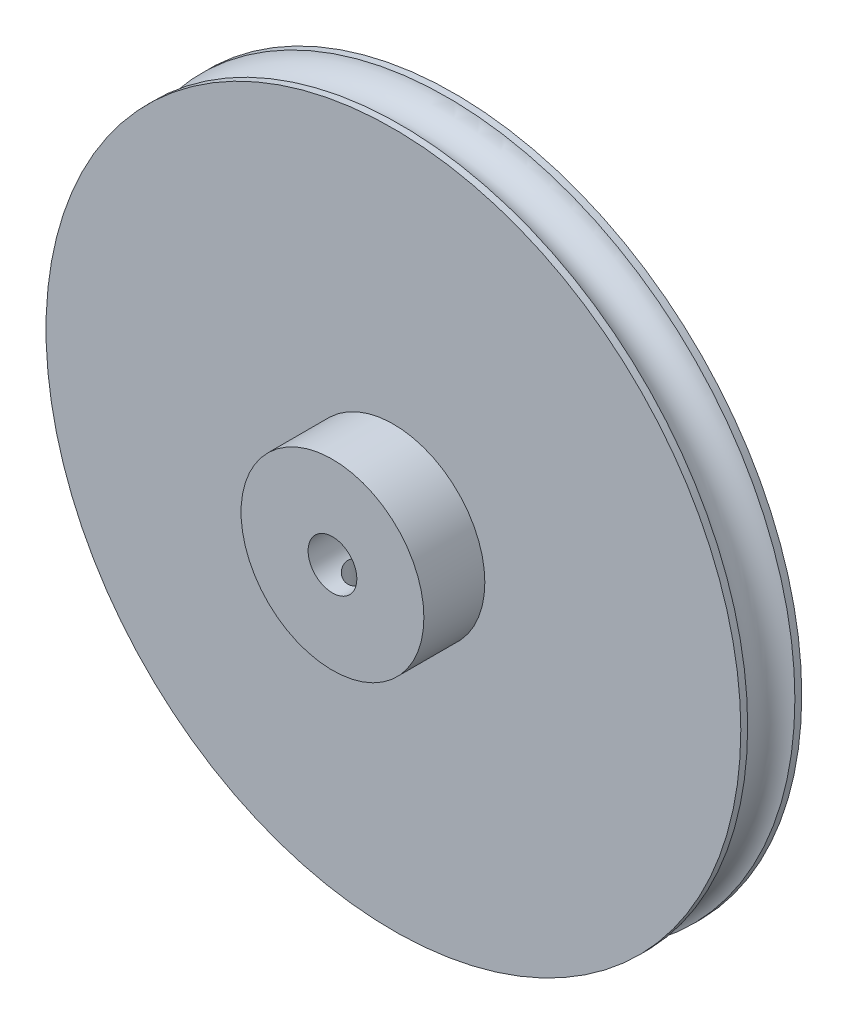
ISO-10303-21;
HEADER;
FILE_DESCRIPTION(('STEP AP214'),'2;1');
FILE_NAME('part.step','',(''),(''),'','','');
FILE_SCHEMA(('AUTOMOTIVE_DESIGN { 1 0 10303 214 1 1 1 1 }'));
ENDSEC;
DATA;
#1=APPLICATION_CONTEXT('core data for automotive mechanical design processes');
#2=APPLICATION_PROTOCOL_DEFINITION('international standard','automotive_design',2000,#1);
#3=PRODUCT_CONTEXT('',#1,'mechanical');
#4=PRODUCT('Part','Part','',(#3));
#5=PRODUCT_RELATED_PRODUCT_CATEGORY('part','',(#4));
#6=PRODUCT_DEFINITION_FORMATION('','',#4);
#7=PRODUCT_DEFINITION_CONTEXT('part definition',#1,'design');
#8=PRODUCT_DEFINITION('design','',#6,#7);
#9=PRODUCT_DEFINITION_SHAPE('','',#8);
#10=(LENGTH_UNIT() NAMED_UNIT(*) SI_UNIT(.MILLI.,.METRE.));
#11=(NAMED_UNIT(*) PLANE_ANGLE_UNIT() SI_UNIT($,.RADIAN.));
#12=(NAMED_UNIT(*) SI_UNIT($,.STERADIAN.) SOLID_ANGLE_UNIT());
#13=UNCERTAINTY_MEASURE_WITH_UNIT(LENGTH_MEASURE(1.E-05),#10,'distance_accuracy_value','');
#14=(GEOMETRIC_REPRESENTATION_CONTEXT(3) GLOBAL_UNCERTAINTY_ASSIGNED_CONTEXT((#13)) GLOBAL_UNIT_ASSIGNED_CONTEXT((#10,
#11,#12)) REPRESENTATION_CONTEXT('',''));
#15=CARTESIAN_POINT('',(0.,0.,0.));
#16=DIRECTION('',(0.,0.,1.));
#17=DIRECTION('',(1.,0.,0.));
#18=AXIS2_PLACEMENT_3D('',#15,#16,#17);
#19=CARTESIAN_POINT('',(0.,0.,-5.));
#20=DIRECTION('',(0.,0.,1.));
#21=DIRECTION('',(1.,0.,0.));
#22=AXIS2_PLACEMENT_3D('',#19,#20,#21);
#23=CYLINDRICAL_SURFACE('',#22,28.5);
#24=CARTESIAN_POINT('',(0.,0.,0.));
#25=DIRECTION('',(0.,0.,1.));
#26=DIRECTION('',(1.,0.,0.));
#27=AXIS2_PLACEMENT_3D('',#24,#25,#26);
#28=CIRCLE('',#27,28.5);
#29=CARTESIAN_POINT('',(28.5,0.,0.));
#30=VERTEX_POINT('',#29);
#31=EDGE_CURVE('E43',#30,#30,#28,.T.);
#32=ORIENTED_EDGE('',*,*,#31,.F.);
#33=EDGE_LOOP('',(#32));
#34=FACE_BOUND('',#33,.T.);
#35=CARTESIAN_POINT('',(0.,0.,-0.563508326896291));
#36=DIRECTION('',(0.,0.,-1.));
#37=DIRECTION('',(-1.,0.,0.));
#38=AXIS2_PLACEMENT_3D('',#35,#36,#37);
#39=CIRCLE('',#38,28.5);
#40=CARTESIAN_POINT('',(-28.5,0.,-0.563508326896291));
#41=VERTEX_POINT('',#40);
#42=EDGE_CURVE('E56',#41,#41,#39,.F.);
#43=ORIENTED_EDGE('',*,*,#42,.T.);
#44=EDGE_LOOP('',(#43));
#45=FACE_BOUND('',#44,.T.);
#46=ADVANCED_FACE('F32',(#34,#45),#23,.T.);
#47=CARTESIAN_POINT('',(0.,0.,-5.));
#48=DIRECTION('',(0.,0.,1.));
#49=DIRECTION('',(1.,0.,0.));
#50=AXIS2_PLACEMENT_3D('',#47,#48,#49);
#51=CIRCLE('',#50,28.5);
#52=CARTESIAN_POINT('',(28.5,0.,-5.));
#53=VERTEX_POINT('',#52);
#54=EDGE_CURVE('E10',#53,#53,#51,.T.);
#55=ORIENTED_EDGE('',*,*,#54,.T.);
#56=EDGE_LOOP('',(#55));
#57=FACE_BOUND('',#56,.T.);
#58=CARTESIAN_POINT('',(0.,0.,-4.43649167310371));
#59=DIRECTION('',(0.,0.,1.));
#60=DIRECTION('',(1.,0.,0.));
#61=AXIS2_PLACEMENT_3D('',#58,#59,#60);
#62=CIRCLE('',#61,28.5);
#63=CARTESIAN_POINT('',(28.5,0.,-4.43649167310371));
#64=VERTEX_POINT('',#63);
#65=EDGE_CURVE('E54',#64,#64,#62,.F.);
#66=ORIENTED_EDGE('',*,*,#65,.T.);
#67=EDGE_LOOP('',(#66));
#68=FACE_BOUND('',#67,.T.);
#69=ADVANCED_FACE('F84',(#57,#68),#23,.T.);
#70=CARTESIAN_POINT('',(0.,0.,0.));
#71=DIRECTION('',(0.,0.,1.));
#72=DIRECTION('',(1.,0.,0.));
#73=AXIS2_PLACEMENT_3D('',#70,#71,#72);
#74=PLANE('',#73);
#75=ORIENTED_EDGE('',*,*,#31,.T.);
#76=EDGE_LOOP('',(#75));
#77=FACE_BOUND('',#76,.T.);
#78=CARTESIAN_POINT('',(0.,0.,0.));
#79=DIRECTION('',(0.,0.,1.));
#80=DIRECTION('',(1.,0.,0.));
#81=AXIS2_PLACEMENT_3D('',#78,#79,#80);
#82=CIRCLE('',#81,7.5);
#83=CARTESIAN_POINT('',(7.5,0.,0.));
#84=VERTEX_POINT('',#83);
#85=EDGE_CURVE('E51',#84,#84,#82,.T.);
#86=ORIENTED_EDGE('',*,*,#85,.F.);
#87=EDGE_LOOP('',(#86));
#88=FACE_BOUND('',#87,.T.);
#89=ADVANCED_FACE('F81',(#77,#88),#74,.T.);
#90=CARTESIAN_POINT('',(0.,0.,-5.));
#91=DIRECTION('',(0.,0.,1.));
#92=DIRECTION('',(1.,0.,0.));
#93=AXIS2_PLACEMENT_3D('',#90,#91,#92);
#94=PLANE('',#93);
#95=CARTESIAN_POINT('',(0.,0.,-5.));
#96=DIRECTION('',(0.,0.,1.));
#97=DIRECTION('',(1.,0.,0.));
#98=AXIS2_PLACEMENT_3D('',#95,#96,#97);
#99=CIRCLE('',#98,2.);
#100=CARTESIAN_POINT('',(2.,0.,-5.));
#101=VERTEX_POINT('',#100);
#102=EDGE_CURVE('E63',#101,#101,#99,.F.);
#103=ORIENTED_EDGE('',*,*,#102,.F.);
#104=EDGE_LOOP('',(#103));
#105=FACE_BOUND('',#104,.T.);
#106=ORIENTED_EDGE('',*,*,#54,.F.);
#107=EDGE_LOOP('',(#106));
#108=FACE_BOUND('',#107,.T.);
#109=ADVANCED_FACE('F83',(#105,#108),#94,.F.);
#110=CARTESIAN_POINT('',(0.,0.,5.));
#111=DIRECTION('',(0.,0.,-1.));
#112=DIRECTION('',(-1.,0.,0.));
#113=AXIS2_PLACEMENT_3D('',#110,#111,#112);
#114=CYLINDRICAL_SURFACE('',#113,7.5);
#115=CARTESIAN_POINT('',(0.,-7.5,3.74999999999999));
#116=CARTESIAN_POINT('',(0.0696954524791068,-7.49999880584412,3.74999720552608));
#117=CARTESIAN_POINT('',(0.139428940919409,-7.49901838956517,3.74415136251553));
#118=CARTESIAN_POINT('',(0.276940110836519,-7.49520172470694,3.72093217061733));
#119=CARTESIAN_POINT('',(0.344715933979621,-7.49236376961945,3.70354822154419));
#120=CARTESIAN_POINT('',(0.476302373606318,-7.48515034118225,3.65779227570361));
#121=CARTESIAN_POINT('',(0.540116184215946,-7.48077612579597,3.6294292671797));
#122=CARTESIAN_POINT('',(0.662070920988967,-7.47097113541035,3.56254385397379));
#123=CARTESIAN_POINT('',(0.72021249493929,-7.46554048127217,3.52402261125849));
#124=CARTESIAN_POINT('',(0.829736307145833,-7.45416658729157,3.43752245808976));
#125=CARTESIAN_POINT('',(0.881056451767477,-7.44821935907428,3.38946544268193));
#126=CARTESIAN_POINT('',(0.974944249329956,-7.43651313438366,3.28542601576359));
#127=CARTESIAN_POINT('',(1.01751134969548,-7.43075414981334,3.22944310427169));
#128=CARTESIAN_POINT('',(1.09293356280256,-7.4200378287989,3.11071451690147));
#129=CARTESIAN_POINT('',(1.12572727643049,-7.41508564545818,3.04792933159762));
#130=CARTESIAN_POINT('',(1.1802791827056,-7.40659894897338,2.91764521784968));
#131=CARTESIAN_POINT('',(1.2020381207828,-7.40306434007154,2.85014660816118));
#132=CARTESIAN_POINT('',(1.23370718889239,-7.39785268421378,2.71300986257173));
#133=CARTESIAN_POINT('',(1.24372451456769,-7.3961588424285,2.6433971317493));
#134=CARTESIAN_POINT('',(1.25195836264493,-7.39476969468325,2.50345986155826));
#135=CARTESIAN_POINT('',(1.25017572019449,-7.39507424728607,2.43313537291635));
#136=CARTESIAN_POINT('',(1.23494754919807,-7.39763214431778,2.29453606936228));
#137=CARTESIAN_POINT('',(1.22162244094488,-7.39986536659459,2.22624759822739));
#138=CARTESIAN_POINT('',(1.18387657020171,-7.40599747605504,2.09288934108544));
#139=CARTESIAN_POINT('',(1.15945542715986,-7.40989642036636,2.02781966555573));
#140=CARTESIAN_POINT('',(1.10008862304695,-7.4189423966705,1.90238558827955));
#141=CARTESIAN_POINT('',(1.06509295693985,-7.42409533553663,1.84204529695939));
#142=CARTESIAN_POINT('',(0.985606008778709,-7.43506459207505,1.72804779973081));
#143=CARTESIAN_POINT('',(0.941113960327136,-7.44088096327143,1.67439113377254));
#144=CARTESIAN_POINT('',(0.84324110607952,-7.45261013939893,1.57458695709633));
#145=CARTESIAN_POINT('',(0.789756981936557,-7.45852324615826,1.52854074072997));
#146=CARTESIAN_POINT('',(0.675767624490818,-7.46971300698362,1.44606111866734));
#147=CARTESIAN_POINT('',(0.615262345953206,-7.47498965694873,1.40962777490839));
#148=CARTESIAN_POINT('',(0.488852958083351,-7.48431946446456,1.34739888643187));
#149=CARTESIAN_POINT('',(0.422944362782327,-7.48837159203724,1.32161229033438));
#150=CARTESIAN_POINT('',(0.287649172801363,-7.4947875150633,1.28150289237702));
#151=CARTESIAN_POINT('',(0.218262869589732,-7.49715145175237,1.26717913151315));
#152=CARTESIAN_POINT('',(0.078854950650811,-7.49990564921343,1.25053932076944));
#153=CARTESIAN_POINT('',(0.00885036857550532,-7.50031876506392,1.24808421409721));
#154=CARTESIAN_POINT('',(-0.130569886444943,-7.49918737210585,1.25488067221407));
#155=CARTESIAN_POINT('',(-0.199985581946018,-7.49764293862059,1.26413178656688));
#156=CARTESIAN_POINT('',(-0.335828087773379,-7.49278413469101,1.29396242466775));
#157=CARTESIAN_POINT('',(-0.402270434192687,-7.48948052400655,1.31447310419507));
#158=CARTESIAN_POINT('',(-0.530773442430217,-7.48147232227679,1.36616725909978));
#159=CARTESIAN_POINT('',(-0.592833857954855,-7.4767676525601,1.39735133381765));
#160=CARTESIAN_POINT('',(-0.711415344734474,-7.46642258151204,1.4698255623484));
#161=CARTESIAN_POINT('',(-0.767882625468568,-7.46077427943511,1.51120257808363));
#162=CARTESIAN_POINT('',(-0.873121792751337,-7.4491923369595,1.60276865769254));
#163=CARTESIAN_POINT('',(-0.921893119848284,-7.44325867585773,1.65295836163834));
#164=CARTESIAN_POINT('',(-1.01087138982899,-7.43170087617923,1.76134877403572));
#165=CARTESIAN_POINT('',(-1.05098438055685,-7.42608058068553,1.81962708275721));
#166=CARTESIAN_POINT('',(-1.12085115514748,-7.41585764888942,1.94217648456927));
#167=CARTESIAN_POINT('',(-1.1506052673849,-7.4112549803301,2.00644738761375));
#168=CARTESIAN_POINT('',(-1.19876916573657,-7.40361726848852,2.13889486640607));
#169=CARTESIAN_POINT('',(-1.21722571627396,-7.40057577155532,2.20705404751525));
#170=CARTESIAN_POINT('',(-1.24241772688913,-7.39638858417631,2.34556006461088));
#171=CARTESIAN_POINT('',(-1.24915420597307,-7.39524272891361,2.41590670986603));
#172=CARTESIAN_POINT('',(-1.25068643302367,-7.39498366542006,2.5558525829812));
#173=CARTESIAN_POINT('',(-1.24563006806258,-7.39584528252825,2.62545018928764));
#174=CARTESIAN_POINT('',(-1.22403991947841,-7.39944890726864,2.76278962402538));
#175=CARTESIAN_POINT('',(-1.20750617305623,-7.40219090880607,2.83053145847093));
#176=CARTESIAN_POINT('',(-1.16348724479744,-7.40923678140859,2.9621792186463));
#177=CARTESIAN_POINT('',(-1.13601479530021,-7.41353883609835,3.02608950502801));
#178=CARTESIAN_POINT('',(-1.07091350195795,-7.42322184461104,3.14841783459742));
#179=CARTESIAN_POINT('',(-1.03328415437427,-7.428602851942,3.20683560518606));
#180=CARTESIAN_POINT('',(-0.94840944218607,-7.43991727022811,3.31726779155387));
#181=CARTESIAN_POINT('',(-0.901055281796816,-7.44585647788151,3.36919800835013));
#182=CARTESIAN_POINT('',(-0.798304515690108,-7.45757186180421,3.46442580223746));
#183=CARTESIAN_POINT('',(-0.742906056456312,-7.46334800013273,3.50772138431908));
#184=CARTESIAN_POINT('',(-0.625184584820136,-7.4741326482111,3.58472413409996));
#185=CARTESIAN_POINT('',(-0.562816393766405,-7.47913558126552,3.61836301965647));
#186=CARTESIAN_POINT('',(-0.433256534689487,-7.48775583800888,3.67463474230495));
#187=CARTESIAN_POINT('',(-0.366069747415002,-7.49137454088741,3.69727854053984));
#188=CARTESIAN_POINT('',(-0.248851655022698,-7.49602895416478,3.72600263706332));
#189=CARTESIAN_POINT('',(-0.199529415149222,-7.49751013636679,3.73498723480797));
#190=CARTESIAN_POINT('',(-0.100144655159903,-7.4994960799306,3.74698686892237));
#191=CARTESIAN_POINT('',(-0.0500821478042465,-7.50000085810321,3.75000200806867));
#192=CARTESIAN_POINT('',(0.,-7.5,3.74999999999999));
#193=B_SPLINE_CURVE_WITH_KNOTS('',3,(#115,#116,#117,#118,#119,#120,#121,#122,#123,#124,#125,
#126,#127,#128,#129,#130,#131,#132,#133,#134,#135,#136,#137,#138,#139,#140,#141,#142,#143,#144,
#145,#146,#147,#148,#149,#150,#151,#152,#153,#154,#155,#156,#157,#158,#159,#160,#161,#162,#163,
#164,#165,#166,#167,#168,#169,#170,#171,#172,#173,#174,#175,#176,#177,#178,#179,#180,#181,#182,
#183,#184,#185,#186,#187,#188,#189,#190,#191,#192),.UNSPECIFIED.,.T.,.F.,(4,2,2,2,2,2,2,2,2,2,2,
2,2,2,2,2,2,2,2,2,2,2,2,2,2,2,2,2,2,2,2,2,2,2,2,2,2,2,4),(0.,0.208903292469253,
0.417998772847707,0.62692343351263,0.835824206337388,1.04651245531165,1.25721400084927,
1.46921260411919,1.68119688438089,1.8912303855171,2.10124902160442,2.30910260880203,
2.51696332512689,2.72582278316277,2.93469910340284,3.14616384955661,3.35762995817921,
3.56927344457949,3.78089922260571,3.99003941745695,4.19917156517926,4.40703903503204,
4.61491817913029,4.82463412813508,5.03436531527137,5.24626911003805,5.45816618687967,
5.66918011170882,5.88017568893304,6.08853954761345,6.29690273094061,6.50502409113106,
6.71315577514663,6.9237569209669,7.1344066693948,7.34651115803594,7.5584037606503,
7.70852124082003,7.85863613638478),.UNSPECIFIED.);
#194=CARTESIAN_POINT('',(0.,-7.5,3.74999999999999));
#195=VERTEX_POINT('',#194);
#196=EDGE_CURVE('E57',#195,#195,#193,.T.);
#197=ORIENTED_EDGE('',*,*,#196,.T.);
#198=EDGE_LOOP('',(#197));
#199=FACE_BOUND('',#198,.T.);
#200=CARTESIAN_POINT('',(0.,0.,5.));
#201=DIRECTION('',(0.,0.,1.));
#202=DIRECTION('',(1.,0.,0.));
#203=AXIS2_PLACEMENT_3D('',#200,#201,#202);
#204=CIRCLE('',#203,7.5);
#205=CARTESIAN_POINT('',(7.5,0.,5.));
#206=VERTEX_POINT('',#205);
#207=EDGE_CURVE('E48',#206,#206,#204,.T.);
#208=ORIENTED_EDGE('',*,*,#207,.F.);
#209=EDGE_LOOP('',(#208));
#210=FACE_BOUND('',#209,.T.);
#211=ORIENTED_EDGE('',*,*,#85,.T.);
#212=EDGE_LOOP('',(#211));
#213=FACE_BOUND('',#212,.T.);
#214=ADVANCED_FACE('F79',(#199,#210,#213),#114,.T.);
#215=CARTESIAN_POINT('',(0.,0.,5.));
#216=DIRECTION('',(0.,0.,1.));
#217=DIRECTION('',(1.,0.,0.));
#218=AXIS2_PLACEMENT_3D('',#215,#216,#217);
#219=PLANE('',#218);
#220=CARTESIAN_POINT('',(0.,0.,5.));
#221=DIRECTION('',(0.,0.,1.));
#222=DIRECTION('',(1.,0.,0.));
#223=AXIS2_PLACEMENT_3D('',#220,#221,#222);
#224=CIRCLE('',#223,2.);
#225=CARTESIAN_POINT('',(2.,0.,5.));
#226=VERTEX_POINT('',#225);
#227=EDGE_CURVE('E59',#226,#226,#224,.T.);
#228=ORIENTED_EDGE('',*,*,#227,.F.);
#229=EDGE_LOOP('',(#228));
#230=FACE_BOUND('',#229,.T.);
#231=ORIENTED_EDGE('',*,*,#207,.T.);
#232=EDGE_LOOP('',(#231));
#233=FACE_BOUND('',#232,.T.);
#234=ADVANCED_FACE('F128',(#230,#233),#219,.T.);
#235=CARTESIAN_POINT('',(0.,0.,-5.001));
#236=DIRECTION('',(0.,0.,1.));
#237=DIRECTION('',(1.,0.,0.));
#238=AXIS2_PLACEMENT_3D('',#235,#236,#237);
#239=CYLINDRICAL_SURFACE('',#238,2.);
#240=CARTESIAN_POINT('',(0.,-2.,3.74999999999999));
#241=CARTESIAN_POINT('',(-0.0635104730002022,-1.99999595305313,3.74999565000121));
#242=CARTESIAN_POINT('',(-0.127096441053757,-1.99694323311001,3.74512698818218));
#243=CARTESIAN_POINT('',(-0.25231826226528,-1.98502167724102,3.72591419657049));
#244=CARTESIAN_POINT('',(-0.313950163299071,-1.97614175574896,3.71155200607451));
#245=CARTESIAN_POINT('',(-0.43320555813678,-1.95345852982134,3.67418863683794));
#246=CARTESIAN_POINT('',(-0.490847243665013,-1.93967960778663,3.65123021215911));
#247=CARTESIAN_POINT('',(-0.601260368868356,-1.90834598486073,3.59761414920324));
#248=CARTESIAN_POINT('',(-0.654032347276148,-1.89079170235271,3.5669573639908));
#249=CARTESIAN_POINT('',(-0.757974192167968,-1.85170152902273,3.49611342681502));
#250=CARTESIAN_POINT('',(-0.808679560769972,-1.82995962224617,3.45536070002454));
#251=CARTESIAN_POINT('',(-0.902986375146753,-1.78531349913632,3.36678082549344));
#252=CARTESIAN_POINT('',(-0.946578107215727,-1.76240774858553,3.31894417174205));
#253=CARTESIAN_POINT('',(-1.03142873237132,-1.71430418655199,3.20996610579548));
#254=CARTESIAN_POINT('',(-1.0715720602915,-1.68921610993413,3.14790021339272));
#255=CARTESIAN_POINT('',(-1.14073966020038,-1.64330198128732,3.01643518455281));
#256=CARTESIAN_POINT('',(-1.16978270899533,-1.62246875996239,2.94704868742392));
#257=CARTESIAN_POINT('',(-1.2093340058598,-1.59309575627365,2.82118947622128));
#258=CARTESIAN_POINT('',(-1.22269552371393,-1.58276905990074,2.76603318146118));
#259=CARTESIAN_POINT('',(-1.24181843585479,-1.56781357325806,2.6536940743892));
#260=CARTESIAN_POINT('',(-1.24759056342087,-1.56317673673693,2.59651424172551));
#261=CARTESIAN_POINT('',(-1.25118918245719,-1.56029885782828,2.48158698324888));
#262=CARTESIAN_POINT('',(-1.2489948372785,-1.56207458771719,2.4238384635376));
#263=CARTESIAN_POINT('',(-1.23676317046803,-1.57177402383921,2.30968989681104));
#264=CARTESIAN_POINT('',(-1.22671956265042,-1.57970265767111,2.25329096796092));
#265=CARTESIAN_POINT('',(-1.19968103371473,-1.60032573121781,2.14456154734252));
#266=CARTESIAN_POINT('',(-1.18285016736896,-1.61290715104815,2.09216754431573));
#267=CARTESIAN_POINT('',(-1.14290189820936,-1.64145566443407,1.99083881759458));
#268=CARTESIAN_POINT('',(-1.11978227193695,-1.65742395501354,1.9419053251255));
#269=CARTESIAN_POINT('',(-1.06294892954948,-1.6945481599302,1.83916672616726));
#270=CARTESIAN_POINT('',(-1.02806296601169,-1.7161159157596,1.78615918987961));
#271=CARTESIAN_POINT('',(-0.950881463002089,-1.76005711791244,1.68616972099952));
#272=CARTESIAN_POINT('',(-0.908578308011424,-1.78243137335976,1.63919406829348));
#273=CARTESIAN_POINT('',(-0.809519713023318,-1.82979894916857,1.54469825062961));
#274=CARTESIAN_POINT('',(-0.75153135359532,-1.85461531676594,1.49836702574117));
#275=CARTESIAN_POINT('',(-0.627148099593557,-1.90028055062445,1.41614910411276));
#276=CARTESIAN_POINT('',(-0.560756523881986,-1.92113097514764,1.38025830227108));
#277=CARTESIAN_POINT('',(-0.424883562934736,-1.95553372961317,1.32223631161858));
#278=CARTESIAN_POINT('',(-0.355763457732359,-1.96941976591574,1.29946596001882));
#279=CARTESIAN_POINT('',(-0.213612154574966,-1.98984929310048,1.2662350720172));
#280=CARTESIAN_POINT('',(-0.140586648341295,-1.9964031799007,1.25575710577801));
#281=CARTESIAN_POINT('',(-0.00451561874058041,-2.00097840540091,1.24843414993881));
#282=CARTESIAN_POINT('',(0.0584027741637924,-2.00012161345511,1.24979682204616));
#283=CARTESIAN_POINT('',(0.182972117996316,-1.99258901494327,1.26188282842074));
#284=CARTESIAN_POINT('',(0.244623154962739,-1.98591360473591,1.27260552509218));
#285=CARTESIAN_POINT('',(0.362521070658194,-1.9677405228307,1.30223853669197));
#286=CARTESIAN_POINT('',(0.418885009953208,-1.95644170526844,1.32081215679666));
#287=CARTESIAN_POINT('',(0.527638281070991,-1.92995684104751,1.36529638927858));
#288=CARTESIAN_POINT('',(0.580026945470718,-1.91477014350266,1.39120823025517));
#289=CARTESIAN_POINT('',(0.685084056277259,-1.87990012356,1.45251520599549));
#290=CARTESIAN_POINT('',(0.737246967843406,-1.85991764817224,1.48860356923825));
#291=CARTESIAN_POINT('',(0.835142640217341,-1.81806970001717,1.56779386515282));
#292=CARTESIAN_POINT('',(0.880868151291854,-1.79620214826384,1.61090358925455));
#293=CARTESIAN_POINT('',(0.971474198022882,-1.74905869713091,1.71013503941267));
#294=CARTESIAN_POINT('',(1.01526851939752,-1.72374883414957,1.7672372062948));
#295=CARTESIAN_POINT('',(1.09280351885684,-1.67566762748172,1.88887578494427));
#296=CARTESIAN_POINT('',(1.12655115718693,-1.65289453322337,1.95340700675301));
#297=CARTESIAN_POINT('',(1.17684772011827,-1.61733530314592,2.07469214805689));
#298=CARTESIAN_POINT('',(1.19551895865479,-1.6034563619378,2.13024075073223));
#299=CARTESIAN_POINT('',(1.22500108205244,-1.58105030663768,2.24439314576893));
#300=CARTESIAN_POINT('',(1.23582424983126,-1.57251483242606,2.30299200945147));
#301=CARTESIAN_POINT('',(1.24901383653653,-1.56206324988732,2.4220902768807));
#302=CARTESIAN_POINT('',(1.25133186963291,-1.5601850167457,2.48259858548818));
#303=CARTESIAN_POINT('',(1.24719778716816,-1.56349063109848,2.60313096036605));
#304=CARTESIAN_POINT('',(1.24074275650141,-1.56867682595587,2.66315485900952));
#305=CARTESIAN_POINT('',(1.22038272403398,-1.58455388771335,2.77602979505137));
#306=CARTESIAN_POINT('',(1.20711919499769,-1.59476808051061,2.82906930141642));
#307=CARTESIAN_POINT('',(1.17417623469512,-1.61917530435691,2.93213505958591));
#308=CARTESIAN_POINT('',(1.15449412799405,-1.63336999423728,2.98216004453751));
#309=CARTESIAN_POINT('',(1.10602690439617,-1.66663902886519,3.0855967438727));
#310=CARTESIAN_POINT('',(1.07633644455459,-1.68612230498998,3.13845029847656));
#311=CARTESIAN_POINT('',(1.01000017036388,-1.72667706411869,3.23893836724601));
#312=CARTESIAN_POINT('',(0.973348732866927,-1.74774982276826,3.28656861256048));
#313=CARTESIAN_POINT('',(0.885670221416046,-1.79401910731182,3.38501425497784));
#314=CARTESIAN_POINT('',(0.83323367424678,-1.81920541808777,3.43459084544548));
#315=CARTESIAN_POINT('',(0.719822446025189,-1.86698729056749,3.52449482970524));
#316=CARTESIAN_POINT('',(0.658842515138534,-1.88958124364395,3.5648164959274));
#317=CARTESIAN_POINT('',(0.529355399891393,-1.92986710976549,3.6347711301241));
#318=CARTESIAN_POINT('',(0.460835727056556,-1.94755071355357,3.66438600540584));
#319=CARTESIAN_POINT('',(0.318394712729486,-1.97581521637843,3.71107188433174));
#320=CARTESIAN_POINT('',(0.244493501106837,-1.98642121428689,3.72818723486977));
#321=CARTESIAN_POINT('',(0.141418481224654,-1.99519472168143,3.74229920916262));
#322=CARTESIAN_POINT('',(0.113248608862862,-1.99699172226301,3.74518186533396));
#323=CARTESIAN_POINT('',(0.0567241864870862,-1.9993953021324,3.74903329153759));
#324=CARTESIAN_POINT('',(0.0283696251514509,-2.00000180773911,3.75000194310998));
#325=CARTESIAN_POINT('',(0.,-2.,3.74999999999999));
#326=B_SPLINE_CURVE_WITH_KNOTS('',3,(#240,#241,#242,#243,#244,#245,#246,#247,#248,#249,#250,
#251,#252,#253,#254,#255,#256,#257,#258,#259,#260,#261,#262,#263,#264,#265,#266,#267,#268,#269,
#270,#271,#272,#273,#274,#275,#276,#277,#278,#279,#280,#281,#282,#283,#284,#285,#286,#287,#288,
#289,#290,#291,#292,#293,#294,#295,#296,#297,#298,#299,#300,#301,#302,#303,#304,#305,#306,#307,
#308,#309,#310,#311,#312,#313,#314,#315,#316,#317,#318,#319,#320,#321,#322,#323,#324,#325),
.UNSPECIFIED.,.T.,.F.,(4,2,2,2,2,2,2,2,2,2,2,2,2,2,2,2,2,2,2,2,2,2,2,2,2,2,2,2,2,2,2,2,2,2,2,2,
2,2,2,2,2,2,4),(0.,0.190412301434131,0.381187894128459,0.571026987595133,0.760845054038791,
0.965821870536212,1.17107628325701,1.40412975852972,1.63678724607009,1.80912008879716,
1.98120894707389,2.15374823498777,2.32642584505082,2.49515839460435,2.66395067908031,
2.86427450354358,3.0648052257518,3.2984218069952,3.53194640727859,3.75284174135957,
3.97342347958128,4.1612718059757,4.34910733732278,4.52959504531295,4.71011298928463,
4.90885230990549,5.10781368827683,5.3356570886371,5.56334227196907,5.74329940313716,
5.92297427413348,6.10366974688196,6.2844252756386,6.45063169037736,6.61690747313438,
6.80725523036974,6.99775741153765,7.22600539035107,7.45439424578495,7.68316725607072,
7.91112460944402,7.99617501232474,8.08123067890581),.UNSPECIFIED.);
#327=CARTESIAN_POINT('',(0.,-2.,3.74999999999999));
#328=VERTEX_POINT('',#327);
#329=EDGE_CURVE('E35',#328,#328,#326,.T.);
#330=ORIENTED_EDGE('',*,*,#329,.T.);
#331=EDGE_LOOP('',(#330));
#332=FACE_BOUND('',#331,.T.);
#333=ORIENTED_EDGE('',*,*,#227,.T.);
#334=EDGE_LOOP('',(#333));
#335=FACE_BOUND('',#334,.T.);
#336=ORIENTED_EDGE('',*,*,#102,.T.);
#337=EDGE_LOOP('',(#336));
#338=FACE_BOUND('',#337,.T.);
#339=ADVANCED_FACE('F120',(#332,#335,#338),#239,.F.);
#340=CARTESIAN_POINT('',(0.,0.,-2.5));
#341=DIRECTION('',(0.,0.,1.));
#342=DIRECTION('',(1.,0.,0.));
#343=AXIS2_PLACEMENT_3D('',#340,#341,#342);
#344=TOROIDAL_SURFACE('',#343,29.,2.);
#345=ORIENTED_EDGE('',*,*,#42,.F.);
#346=EDGE_LOOP('',(#345));
#347=FACE_BOUND('',#346,.T.);
#348=ORIENTED_EDGE('',*,*,#65,.F.);
#349=EDGE_LOOP('',(#348));
#350=FACE_BOUND('',#349,.T.);
#351=ADVANCED_FACE('F111',(#347,#350),#344,.F.);
#352=CARTESIAN_POINT('',(0.,0.,2.5));
#353=DIRECTION('',(0.,1.,0.));
#354=DIRECTION('',(0.,0.,1.));
#355=AXIS2_PLACEMENT_3D('',#352,#353,#354);
#356=CYLINDRICAL_SURFACE('',#355,1.24999999999999);
#357=ORIENTED_EDGE('',*,*,#329,.F.);
#358=EDGE_LOOP('',(#357));
#359=FACE_BOUND('',#358,.T.);
#360=ORIENTED_EDGE('',*,*,#196,.F.);
#361=EDGE_LOOP('',(#360));
#362=FACE_BOUND('',#361,.T.);
#363=ADVANCED_FACE('F107',(#359,#362),#356,.F.);
#364=CLOSED_SHELL('',(#46,#69,#89,#109,#214,#234,#339,#351,#363));
#365=MANIFOLD_SOLID_BREP('B2',#364);
#366=ADVANCED_BREP_SHAPE_REPRESENTATION('',(#18,#365),#14);
#367=SHAPE_DEFINITION_REPRESENTATION(#9,#366);
ENDSEC;
END-ISO-10303-21;
